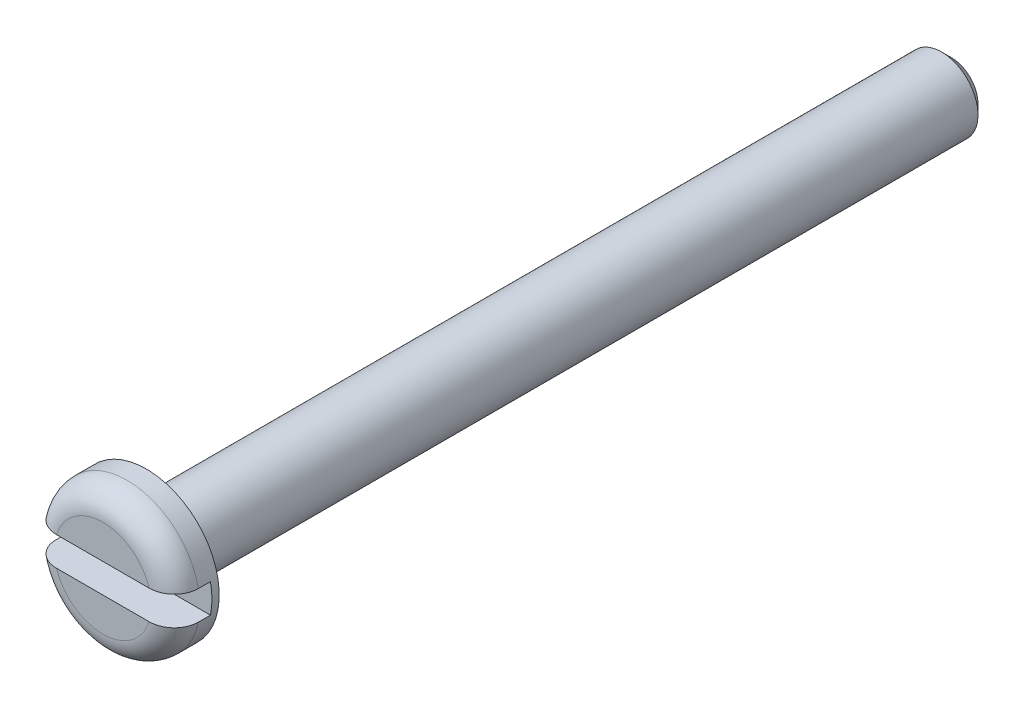
ISO-10303-21;
HEADER;
FILE_DESCRIPTION(('STEP AP214'),'2;1');
FILE_NAME('part.step','',(''),(''),'','','');
FILE_SCHEMA(('AUTOMOTIVE_DESIGN { 1 0 10303 214 1 1 1 1 }'));
ENDSEC;
DATA;
#1=APPLICATION_CONTEXT('core data for automotive mechanical design processes');
#2=APPLICATION_PROTOCOL_DEFINITION('international standard','automotive_design',2000,#1);
#3=PRODUCT_CONTEXT('',#1,'mechanical');
#4=PRODUCT('Part','Part','',(#3));
#5=PRODUCT_RELATED_PRODUCT_CATEGORY('part','',(#4));
#6=PRODUCT_DEFINITION_FORMATION('','',#4);
#7=PRODUCT_DEFINITION_CONTEXT('part definition',#1,'design');
#8=PRODUCT_DEFINITION('design','',#6,#7);
#9=PRODUCT_DEFINITION_SHAPE('','',#8);
#10=(LENGTH_UNIT() NAMED_UNIT(*) SI_UNIT(.MILLI.,.METRE.));
#11=(NAMED_UNIT(*) PLANE_ANGLE_UNIT() SI_UNIT($,.RADIAN.));
#12=(NAMED_UNIT(*) SI_UNIT($,.STERADIAN.) SOLID_ANGLE_UNIT());
#13=UNCERTAINTY_MEASURE_WITH_UNIT(LENGTH_MEASURE(1.E-05),#10,'distance_accuracy_value','');
#14=(GEOMETRIC_REPRESENTATION_CONTEXT(3) GLOBAL_UNCERTAINTY_ASSIGNED_CONTEXT((#13)) GLOBAL_UNIT_ASSIGNED_CONTEXT((#10,
#11,#12)) REPRESENTATION_CONTEXT('',''));
#15=CARTESIAN_POINT('',(0.,0.,0.));
#16=DIRECTION('',(0.,0.,1.));
#17=DIRECTION('',(1.,0.,0.));
#18=AXIS2_PLACEMENT_3D('',#15,#16,#17);
#19=CARTESIAN_POINT('',(0.,0.,0.));
#20=DIRECTION('',(0.,0.,1.));
#21=DIRECTION('',(1.,0.,0.));
#22=AXIS2_PLACEMENT_3D('',#19,#20,#21);
#23=PLANE('',#22);
#24=DIRECTION('',(1.,0.,0.));
#25=VECTOR('',#24,1.);
#26=CARTESIAN_POINT('',(-3.,-0.6,0.));
#27=LINE('',#26,#25);
#28=CARTESIAN_POINT('',(-1.90787840283389,-0.6,0.));
#29=VERTEX_POINT('',#28);
#30=CARTESIAN_POINT('',(1.90787840283389,-0.6,0.));
#31=VERTEX_POINT('',#30);
#32=EDGE_CURVE('E124',#29,#31,#27,.T.);
#33=ORIENTED_EDGE('',*,*,#32,.F.);
#34=CARTESIAN_POINT('',(0.,0.,0.));
#35=DIRECTION('',(0.,0.,1.));
#36=DIRECTION('',(1.,0.,0.));
#37=AXIS2_PLACEMENT_3D('',#34,#35,#36);
#38=CIRCLE('',#37,2.);
#39=EDGE_CURVE('E140',#29,#31,#38,.T.);
#40=ORIENTED_EDGE('',*,*,#39,.T.);
#41=EDGE_LOOP('',(#33,#40));
#42=FACE_BOUND('',#41,.T.);
#43=ADVANCED_FACE('F34',(#42),#23,.T.);
#44=DIRECTION('',(1.,0.,0.));
#45=VECTOR('',#44,1.);
#46=CARTESIAN_POINT('',(-3.,0.6,0.));
#47=LINE('',#46,#45);
#48=CARTESIAN_POINT('',(-1.90787840283389,0.6,0.));
#49=VERTEX_POINT('',#48);
#50=CARTESIAN_POINT('',(1.90787840283389,0.6,0.));
#51=VERTEX_POINT('',#50);
#52=EDGE_CURVE('E106',#49,#51,#47,.T.);
#53=ORIENTED_EDGE('',*,*,#52,.T.);
#54=CARTESIAN_POINT('',(0.,0.,0.));
#55=DIRECTION('',(0.,0.,1.));
#56=DIRECTION('',(1.,0.,0.));
#57=AXIS2_PLACEMENT_3D('',#54,#55,#56);
#58=CIRCLE('',#57,2.);
#59=EDGE_CURVE('E55',#51,#49,#58,.T.);
#60=ORIENTED_EDGE('',*,*,#59,.T.);
#61=EDGE_LOOP('',(#53,#60));
#62=FACE_BOUND('',#61,.T.);
#63=ADVANCED_FACE('F188',(#62),#23,.T.);
#64=CARTESIAN_POINT('',(0.,0.,-35.));
#65=DIRECTION('',(0.,0.,-1.));
#66=DIRECTION('',(-1.,0.,0.));
#67=AXIS2_PLACEMENT_3D('',#64,#65,#66);
#68=CYLINDRICAL_SURFACE('',#67,3.);
#69=DIRECTION('',(0.,0.,-1.));
#70=VECTOR('',#69,1.);
#71=CARTESIAN_POINT('',(2.93938769133981,-0.6,-35.));
#72=LINE('',#71,#70);
#73=CARTESIAN_POINT('',(2.93938769133981,-0.6,-1.));
#74=VERTEX_POINT('',#73);
#75=CARTESIAN_POINT('',(2.93938769133981,-0.6,-1.5));
#76=VERTEX_POINT('',#75);
#77=EDGE_CURVE('E97',#74,#76,#72,.T.);
#78=ORIENTED_EDGE('',*,*,#77,.F.);
#79=CARTESIAN_POINT('',(0.,0.,-1.));
#80=DIRECTION('',(0.,0.,1.));
#81=DIRECTION('',(1.,0.,0.));
#82=AXIS2_PLACEMENT_3D('',#79,#80,#81);
#83=CIRCLE('',#82,3.);
#84=CARTESIAN_POINT('',(-2.93938769133981,-0.6,-1.));
#85=VERTEX_POINT('',#84);
#86=EDGE_CURVE('E141',#74,#85,#83,.F.);
#87=ORIENTED_EDGE('',*,*,#86,.T.);
#88=DIRECTION('',(0.,0.,-1.));
#89=VECTOR('',#88,1.);
#90=CARTESIAN_POINT('',(-2.93938769133982,-0.6,-35.));
#91=LINE('',#90,#89);
#92=CARTESIAN_POINT('',(-2.93938769133981,-0.6,-1.5));
#93=VERTEX_POINT('',#92);
#94=EDGE_CURVE('E114',#93,#85,#91,.F.);
#95=ORIENTED_EDGE('',*,*,#94,.F.);
#96=CARTESIAN_POINT('',(0.,0.,-1.5));
#97=DIRECTION('',(0.,0.,-1.));
#98=DIRECTION('',(-1.,0.,0.));
#99=AXIS2_PLACEMENT_3D('',#96,#97,#98);
#100=CIRCLE('',#99,3.);
#101=CARTESIAN_POINT('',(-2.93938769133981,0.6,-1.5));
#102=VERTEX_POINT('',#101);
#103=EDGE_CURVE('E98',#102,#93,#100,.F.);
#104=ORIENTED_EDGE('',*,*,#103,.F.);
#105=DIRECTION('',(0.,0.,-1.));
#106=VECTOR('',#105,1.);
#107=CARTESIAN_POINT('',(-2.93938769133982,0.6,-35.));
#108=LINE('',#107,#106);
#109=CARTESIAN_POINT('',(-2.93938769133981,0.6,-1.));
#110=VERTEX_POINT('',#109);
#111=EDGE_CURVE('E86',#110,#102,#108,.T.);
#112=ORIENTED_EDGE('',*,*,#111,.F.);
#113=CARTESIAN_POINT('',(0.,0.,-1.));
#114=DIRECTION('',(0.,0.,1.));
#115=DIRECTION('',(1.,0.,0.));
#116=AXIS2_PLACEMENT_3D('',#113,#114,#115);
#117=CIRCLE('',#116,3.);
#118=CARTESIAN_POINT('',(2.93938769133981,0.6,-1.));
#119=VERTEX_POINT('',#118);
#120=EDGE_CURVE('E144',#110,#119,#117,.F.);
#121=ORIENTED_EDGE('',*,*,#120,.T.);
#122=DIRECTION('',(0.,0.,-1.));
#123=VECTOR('',#122,1.);
#124=CARTESIAN_POINT('',(2.93938769133981,0.6,-35.));
#125=LINE('',#124,#123);
#126=CARTESIAN_POINT('',(2.93938769133981,0.6,-1.5));
#127=VERTEX_POINT('',#126);
#128=EDGE_CURVE('E115',#127,#119,#125,.F.);
#129=ORIENTED_EDGE('',*,*,#128,.F.);
#130=EDGE_CURVE('E105',#76,#127,#100,.F.);
#131=ORIENTED_EDGE('',*,*,#130,.F.);
#132=EDGE_LOOP('',(#78,#87,#95,#104,#112,#121,#129,#131));
#133=FACE_BOUND('',#132,.T.);
#134=CARTESIAN_POINT('',(0.,0.,-1.8));
#135=DIRECTION('',(0.,0.,-1.));
#136=DIRECTION('',(-1.,0.,0.));
#137=AXIS2_PLACEMENT_3D('',#134,#135,#136);
#138=CIRCLE('',#137,3.);
#139=CARTESIAN_POINT('',(-3.,0.,-1.8));
#140=VERTEX_POINT('',#139);
#141=EDGE_CURVE('E119',#140,#140,#138,.T.);
#142=ORIENTED_EDGE('',*,*,#141,.F.);
#143=EDGE_LOOP('',(#142));
#144=FACE_BOUND('',#143,.T.);
#145=ADVANCED_FACE('F110',(#133,#144),#68,.T.);
#146=CARTESIAN_POINT('',(-3.,0.,-1.8));
#147=DIRECTION('',(0.,0.,-1.));
#148=DIRECTION('',(-1.,0.,0.));
#149=AXIS2_PLACEMENT_3D('',#146,#147,#148);
#150=PLANE('',#149);
#151=CARTESIAN_POINT('',(0.,0.,-1.8));
#152=DIRECTION('',(0.,0.,-1.));
#153=DIRECTION('',(-1.,0.,0.));
#154=AXIS2_PLACEMENT_3D('',#151,#152,#153);
#155=CIRCLE('',#154,1.9);
#156=CARTESIAN_POINT('',(-1.9,0.,-1.8));
#157=VERTEX_POINT('',#156);
#158=EDGE_CURVE('E11',#157,#157,#155,.F.);
#159=ORIENTED_EDGE('',*,*,#158,.T.);
#160=EDGE_LOOP('',(#159));
#161=FACE_BOUND('',#160,.T.);
#162=ORIENTED_EDGE('',*,*,#141,.T.);
#163=EDGE_LOOP('',(#162));
#164=FACE_BOUND('',#163,.T.);
#165=ADVANCED_FACE('F219',(#161,#164),#150,.T.);
#166=CARTESIAN_POINT('',(0.,0.,-35.));
#167=DIRECTION('',(0.,0.,-1.));
#168=DIRECTION('',(-1.,0.,0.));
#169=AXIS2_PLACEMENT_3D('',#166,#167,#168);
#170=CYLINDRICAL_SURFACE('',#169,1.5);
#171=CARTESIAN_POINT('',(0.,0.,-2.2));
#172=DIRECTION('',(0.,0.,-1.));
#173=DIRECTION('',(-1.,0.,0.));
#174=AXIS2_PLACEMENT_3D('',#171,#172,#173);
#175=CIRCLE('',#174,1.5);
#176=CARTESIAN_POINT('',(-1.5,0.,-2.2));
#177=VERTEX_POINT('',#176);
#178=EDGE_CURVE('E42',#177,#177,#175,.T.);
#179=ORIENTED_EDGE('',*,*,#178,.T.);
#180=EDGE_LOOP('',(#179));
#181=FACE_BOUND('',#180,.T.);
#182=CARTESIAN_POINT('',(0.,0.,-34.6));
#183=DIRECTION('',(0.,0.,-1.));
#184=DIRECTION('',(-1.,0.,0.));
#185=AXIS2_PLACEMENT_3D('',#182,#183,#184);
#186=CIRCLE('',#185,1.5);
#187=CARTESIAN_POINT('',(-1.5,0.,-34.6));
#188=VERTEX_POINT('',#187);
#189=EDGE_CURVE('E202',#188,#188,#186,.F.);
#190=ORIENTED_EDGE('',*,*,#189,.T.);
#191=EDGE_LOOP('',(#190));
#192=FACE_BOUND('',#191,.T.);
#193=ADVANCED_FACE('F214',(#181,#192),#170,.T.);
#194=CARTESIAN_POINT('',(-1.5,0.,-35.));
#195=DIRECTION('',(0.,0.,-1.));
#196=DIRECTION('',(-1.,0.,0.));
#197=AXIS2_PLACEMENT_3D('',#194,#195,#196);
#198=PLANE('',#197);
#199=CARTESIAN_POINT('',(0.,0.,-35.));
#200=DIRECTION('',(0.,0.,-1.));
#201=DIRECTION('',(-1.,0.,0.));
#202=AXIS2_PLACEMENT_3D('',#199,#200,#201);
#203=CIRCLE('',#202,1.1);
#204=CARTESIAN_POINT('',(-1.1,0.,-35.));
#205=VERTEX_POINT('',#204);
#206=EDGE_CURVE('E205',#205,#205,#203,.T.);
#207=ORIENTED_EDGE('',*,*,#206,.T.);
#208=EDGE_LOOP('',(#207));
#209=FACE_BOUND('',#208,.T.);
#210=ADVANCED_FACE('F218',(#209),#198,.T.);
#211=CARTESIAN_POINT('',(-3.,0.6,-1.5));
#212=DIRECTION('',(0.,0.,-1.));
#213=DIRECTION('',(-1.,0.,0.));
#214=AXIS2_PLACEMENT_3D('',#211,#212,#213);
#215=PLANE('',#214);
#216=DIRECTION('',(1.,0.,0.));
#217=VECTOR('',#216,1.);
#218=CARTESIAN_POINT('',(-3.,-0.6,-1.5));
#219=LINE('',#218,#217);
#220=EDGE_CURVE('E121',#93,#76,#219,.T.);
#221=ORIENTED_EDGE('',*,*,#220,.T.);
#222=ORIENTED_EDGE('',*,*,#130,.T.);
#223=DIRECTION('',(1.,0.,0.));
#224=VECTOR('',#223,1.);
#225=CARTESIAN_POINT('',(-3.,0.6,-1.5));
#226=LINE('',#225,#224);
#227=EDGE_CURVE('E89',#102,#127,#226,.T.);
#228=ORIENTED_EDGE('',*,*,#227,.F.);
#229=ORIENTED_EDGE('',*,*,#103,.T.);
#230=EDGE_LOOP('',(#221,#222,#228,#229));
#231=FACE_BOUND('',#230,.T.);
#232=ADVANCED_FACE('F102',(#231),#215,.F.);
#233=CARTESIAN_POINT('',(-3.,-0.6,0.));
#234=DIRECTION('',(0.,-1.,0.));
#235=DIRECTION('',(0.,0.,-1.));
#236=AXIS2_PLACEMENT_3D('',#233,#234,#235);
#237=PLANE('',#236);
#238=ORIENTED_EDGE('',*,*,#94,.T.);
#239=CARTESIAN_POINT('',(-2.93938769133981,-0.6,-1.));
#240=CARTESIAN_POINT('',(-2.93938770276771,-0.6,-0.972321638172543));
#241=CARTESIAN_POINT('',(-2.93821410236521,-0.6,-0.944656636253291));
#242=CARTESIAN_POINT('',(-2.93353349431521,-0.6,-0.889526861951234));
#243=CARTESIAN_POINT('',(-2.93002666366249,-0.6,-0.862062074540261));
#244=CARTESIAN_POINT('',(-2.91604632548902,-0.6,-0.780336207939879));
#245=CARTESIAN_POINT('',(-2.90211283648053,-0.6,-0.726626269474018));
#246=CARTESIAN_POINT('',(-2.86543751133069,-0.6,-0.622315882638988));
#247=CARTESIAN_POINT('',(-2.84269266515645,-0.6,-0.571716503714319));
#248=CARTESIAN_POINT('',(-2.78908511252595,-0.6,-0.475017339731336));
#249=CARTESIAN_POINT('',(-2.75822276982181,-0.6,-0.428917353178188));
#250=CARTESIAN_POINT('',(-2.68907078438919,-0.6,-0.342172235650511));
#251=CARTESIAN_POINT('',(-2.65073286093572,-0.6,-0.301565637861829));
#252=CARTESIAN_POINT('',(-2.56789366745151,-0.6,-0.227220078447088));
#253=CARTESIAN_POINT('',(-2.52339168993973,-0.6,-0.193481906245863));
#254=CARTESIAN_POINT('',(-2.42861084794114,-0.6,-0.133118586778812));
#255=CARTESIAN_POINT('',(-2.37823822200287,-0.6,-0.106640901724304));
#256=CARTESIAN_POINT('',(-2.27384844267111,-0.6,-0.0622394746542688));
#257=CARTESIAN_POINT('',(-2.21983105484844,-0.6,-0.0443162834590483));
#258=CARTESIAN_POINT('',(-2.12272739795855,-0.6,-0.02052714338367));
#259=CARTESIAN_POINT('',(-2.08008208035747,-0.6,-0.0128109577036062));
#260=CARTESIAN_POINT('',(-1.99425117998488,-0.6,-0.00254656462218898));
#261=CARTESIAN_POINT('',(-1.95106672026031,-0.6,1.10118978048816E-05));
#262=CARTESIAN_POINT('',(-1.90787840283389,-0.6,0.));
#263=B_SPLINE_CURVE_WITH_KNOTS('',3,(#239,#240,#241,#242,#243,#244,#245,#246,#247,#248,#249,
#250,#251,#252,#253,#254,#255,#256,#257,#258,#259,#260,#261,#262),.UNSPECIFIED.,.F.,.F.,(4,2,2,
2,2,2,2,2,2,2,2,4),(0.,0.0829837302474587,0.165961166211744,0.331568485715387,0.497232428013334,
0.662888948029177,0.829653081163284,0.996436370582135,1.16639122945738,1.33635703017953,
1.46606963518821,1.59554644193424),.UNSPECIFIED.);
#264=EDGE_CURVE('E134',#85,#29,#263,.T.);
#265=ORIENTED_EDGE('',*,*,#264,.T.);
#266=ORIENTED_EDGE('',*,*,#32,.T.);
#267=CARTESIAN_POINT('',(1.90787840283389,-0.6,0.));
#268=CARTESIAN_POINT('',(1.93773529066291,-0.6,-2.47548866331322E-07));
#269=CARTESIAN_POINT('',(1.96758017570234,-0.6,-0.00121770334634671));
#270=CARTESIAN_POINT('',(2.02707319186661,-0.6,-0.00610610499452562));
#271=CARTESIAN_POINT('',(2.05672128723217,-0.6,-0.009777485060849));
#272=CARTESIAN_POINT('',(2.14508838456847,-0.6,-0.0244993421219322));
#273=CARTESIAN_POINT('',(2.20323726850145,-0.6,-0.0392575272754314));
#274=CARTESIAN_POINT('',(2.3162480976835,-0.6,-0.0784798945949695));
#275=CARTESIAN_POINT('',(2.37110469865989,-0.6,-0.102959391387223));
#276=CARTESIAN_POINT('',(2.47571188316476,-0.6,-0.161057784489942));
#277=CARTESIAN_POINT('',(2.52546640218046,-0.6,-0.194669562459341));
#278=CARTESIAN_POINT('',(2.61684428964092,-0.6,-0.268970846938747));
#279=CARTESIAN_POINT('',(2.65867082350486,-0.6,-0.309410609137931));
#280=CARTESIAN_POINT('',(2.73471620678002,-0.6,-0.396932843703631));
#281=CARTESIAN_POINT('',(2.76893342699587,-0.6,-0.444016735093837));
#282=CARTESIAN_POINT('',(2.82779584490307,-0.6,-0.542047078322588));
#283=CARTESIAN_POINT('',(2.85267997210062,-0.6,-0.592850377348578));
#284=CARTESIAN_POINT('',(2.89338734810243,-0.6,-0.69794169710247));
#285=CARTESIAN_POINT('',(2.9092191570073,-0.6,-0.752226371536844));
#286=CARTESIAN_POINT('',(2.92663542181648,-0.6,-0.839129838729081));
#287=CARTESIAN_POINT('',(2.93141571310145,-0.6,-0.871141118720766));
#288=CARTESIAN_POINT('',(2.9377903551294,-0.6,-0.935429884254392));
#289=CARTESIAN_POINT('',(2.93938956207185,-0.6,-0.967706888381689));
#290=CARTESIAN_POINT('',(2.93938769133981,-0.6,-1.));
#291=B_SPLINE_CURVE_WITH_KNOTS('',3,(#267,#268,#269,#270,#271,#272,#273,#274,#275,#276,#277,
#278,#279,#280,#281,#282,#283,#284,#285,#286,#287,#288,#289,#290),.UNSPECIFIED.,.F.,.F.,(4,2,2,
2,2,2,2,2,2,2,2,4),(0.,0.089520567636369,0.17905697990329,0.358108854014581,0.537443926548799,
0.716639611790978,0.890318718479495,1.06403497508267,1.23293840849202,1.40168185727531,
1.49863809906623,1.59544621485453),.UNSPECIFIED.);
#292=EDGE_CURVE('E133',#31,#74,#291,.T.);
#293=ORIENTED_EDGE('',*,*,#292,.T.);
#294=ORIENTED_EDGE('',*,*,#77,.T.);
#295=ORIENTED_EDGE('',*,*,#220,.F.);
#296=EDGE_LOOP('',(#238,#265,#266,#293,#294,#295));
#297=FACE_BOUND('',#296,.T.);
#298=ADVANCED_FACE('F132',(#297),#237,.F.);
#299=CARTESIAN_POINT('',(-3.,0.6,0.));
#300=DIRECTION('',(0.,1.,0.));
#301=DIRECTION('',(0.,0.,1.));
#302=AXIS2_PLACEMENT_3D('',#299,#300,#301);
#303=PLANE('',#302);
#304=ORIENTED_EDGE('',*,*,#128,.T.);
#305=CARTESIAN_POINT('',(2.93938769133981,0.6,-1.));
#306=CARTESIAN_POINT('',(2.93938770276771,0.6,-0.972321638172543));
#307=CARTESIAN_POINT('',(2.93821410236521,0.6,-0.944656636253291));
#308=CARTESIAN_POINT('',(2.93353349431521,0.6,-0.889526861951235));
#309=CARTESIAN_POINT('',(2.93002666366249,0.6,-0.862062074540261));
#310=CARTESIAN_POINT('',(2.91604632548902,0.6,-0.78033620793988));
#311=CARTESIAN_POINT('',(2.90211283648053,0.6,-0.726626269474018));
#312=CARTESIAN_POINT('',(2.86543751133069,0.6,-0.622315882638988));
#313=CARTESIAN_POINT('',(2.84269266515645,0.6,-0.57171650371432));
#314=CARTESIAN_POINT('',(2.78908511252595,0.6,-0.475017339731337));
#315=CARTESIAN_POINT('',(2.75822276982181,0.6,-0.428917353178188));
#316=CARTESIAN_POINT('',(2.68907078438919,0.6,-0.342172235650512));
#317=CARTESIAN_POINT('',(2.65073286093572,0.6,-0.30156563786183));
#318=CARTESIAN_POINT('',(2.56789366745151,0.6,-0.227220078447088));
#319=CARTESIAN_POINT('',(2.52339168993973,0.6,-0.193481906245864));
#320=CARTESIAN_POINT('',(2.42861084794114,0.6,-0.133118586778813));
#321=CARTESIAN_POINT('',(2.37823822200287,0.6,-0.106640901724304));
#322=CARTESIAN_POINT('',(2.27384844267111,0.6,-0.0622394746542692));
#323=CARTESIAN_POINT('',(2.21983105484844,0.6,-0.0443162834590487));
#324=CARTESIAN_POINT('',(2.12272739795855,0.6,-0.0205271433836705));
#325=CARTESIAN_POINT('',(2.08008208035747,0.6,-0.0128109577036068));
#326=CARTESIAN_POINT('',(1.99425117998488,0.6,-0.00254656462218969));
#327=CARTESIAN_POINT('',(1.95106672026031,0.6,1.10118978042003E-05));
#328=CARTESIAN_POINT('',(1.90787840283389,0.6,0.));
#329=B_SPLINE_CURVE_WITH_KNOTS('',3,(#305,#306,#307,#308,#309,#310,#311,#312,#313,#314,#315,
#316,#317,#318,#319,#320,#321,#322,#323,#324,#325,#326,#327,#328),.UNSPECIFIED.,.F.,.F.,(4,2,2,
2,2,2,2,2,2,2,2,4),(0.,0.0829837302474586,0.165961166211745,0.331568485715387,0.497232428013334,
0.662888948029178,0.829653081163284,0.996436370582135,1.16639122945738,1.33635703017953,
1.46606963518821,1.59554644193424),.UNSPECIFIED.);
#330=EDGE_CURVE('E49',#119,#51,#329,.T.);
#331=ORIENTED_EDGE('',*,*,#330,.T.);
#332=ORIENTED_EDGE('',*,*,#52,.F.);
#333=CARTESIAN_POINT('',(-1.90787840283389,0.6,0.));
#334=CARTESIAN_POINT('',(-1.93773529066291,0.6,-2.47548865933866E-07));
#335=CARTESIAN_POINT('',(-1.96758017570234,0.6,-0.00121770334634627));
#336=CARTESIAN_POINT('',(-2.02707319186661,0.6,-0.00610610499452514));
#337=CARTESIAN_POINT('',(-2.05672128723217,0.6,-0.00977748506084853));
#338=CARTESIAN_POINT('',(-2.14508838456847,0.6,-0.0244993421219318));
#339=CARTESIAN_POINT('',(-2.20323726850145,0.6,-0.0392575272754311));
#340=CARTESIAN_POINT('',(-2.3162480976835,0.6,-0.0784798945949692));
#341=CARTESIAN_POINT('',(-2.37110469865989,0.6,-0.102959391387223));
#342=CARTESIAN_POINT('',(-2.47571188316476,0.6,-0.161057784489941));
#343=CARTESIAN_POINT('',(-2.52546640218046,0.6,-0.194669562459341));
#344=CARTESIAN_POINT('',(-2.61684428964092,0.6,-0.268970846938746));
#345=CARTESIAN_POINT('',(-2.65867082350486,0.6,-0.30941060913793));
#346=CARTESIAN_POINT('',(-2.73471620678002,0.6,-0.39693284370363));
#347=CARTESIAN_POINT('',(-2.76893342699587,0.6,-0.444016735093837));
#348=CARTESIAN_POINT('',(-2.82779584490307,0.6,-0.542047078322588));
#349=CARTESIAN_POINT('',(-2.85267997210062,0.6,-0.592850377348577));
#350=CARTESIAN_POINT('',(-2.89338734810243,0.6,-0.697941697102469));
#351=CARTESIAN_POINT('',(-2.9092191570073,0.6,-0.752226371536844));
#352=CARTESIAN_POINT('',(-2.92663542181648,0.6,-0.839129838729081));
#353=CARTESIAN_POINT('',(-2.93141571310145,0.6,-0.871141118720766));
#354=CARTESIAN_POINT('',(-2.9377903551294,0.6,-0.935429884254392));
#355=CARTESIAN_POINT('',(-2.93938956207185,0.6,-0.967706888381688));
#356=CARTESIAN_POINT('',(-2.93938769133981,0.6,-1.));
#357=B_SPLINE_CURVE_WITH_KNOTS('',3,(#333,#334,#335,#336,#337,#338,#339,#340,#341,#342,#343,
#344,#345,#346,#347,#348,#349,#350,#351,#352,#353,#354,#355,#356),.UNSPECIFIED.,.F.,.F.,(4,2,2,
2,2,2,2,2,2,2,2,4),(0.,0.089520567636369,0.17905697990329,0.358108854014581,0.537443926548799,
0.716639611790978,0.890318718479495,1.06403497508267,1.23293840849202,1.40168185727531,
1.49863809906623,1.59544621485453),.UNSPECIFIED.);
#358=EDGE_CURVE('E92',#49,#110,#357,.T.);
#359=ORIENTED_EDGE('',*,*,#358,.T.);
#360=ORIENTED_EDGE('',*,*,#111,.T.);
#361=ORIENTED_EDGE('',*,*,#227,.T.);
#362=EDGE_LOOP('',(#304,#331,#332,#359,#360,#361));
#363=FACE_BOUND('',#362,.T.);
#364=ADVANCED_FACE('F88',(#363),#303,.F.);
#365=CARTESIAN_POINT('',(0.,0.,-35.));
#366=DIRECTION('',(0.,0.,1.));
#367=DIRECTION('',(1.,0.,0.));
#368=AXIS2_PLACEMENT_3D('',#365,#366,#367);
#369=CONICAL_SURFACE('',#368,1.1,0.785398163397447);
#370=ORIENTED_EDGE('',*,*,#189,.F.);
#371=EDGE_LOOP('',(#370));
#372=FACE_BOUND('',#371,.T.);
#373=ORIENTED_EDGE('',*,*,#206,.F.);
#374=EDGE_LOOP('',(#373));
#375=FACE_BOUND('',#374,.T.);
#376=ADVANCED_FACE('F165',(#372,#375),#369,.T.);
#377=CARTESIAN_POINT('',(0.,0.,-1.));
#378=DIRECTION('',(0.,0.,1.));
#379=DIRECTION('',(1.,0.,0.));
#380=AXIS2_PLACEMENT_3D('',#377,#378,#379);
#381=TOROIDAL_SURFACE('',#380,2.,1.);
#382=ORIENTED_EDGE('',*,*,#292,.F.);
#383=ORIENTED_EDGE('',*,*,#39,.F.);
#384=ORIENTED_EDGE('',*,*,#264,.F.);
#385=ORIENTED_EDGE('',*,*,#86,.F.);
#386=EDGE_LOOP('',(#382,#383,#384,#385));
#387=FACE_BOUND('',#386,.T.);
#388=ADVANCED_FACE('F139',(#387),#381,.T.);
#389=CARTESIAN_POINT('',(0.,0.,-1.));
#390=DIRECTION('',(0.,0.,1.));
#391=DIRECTION('',(1.,0.,0.));
#392=AXIS2_PLACEMENT_3D('',#389,#390,#391);
#393=TOROIDAL_SURFACE('',#392,2.,1.);
#394=ORIENTED_EDGE('',*,*,#358,.F.);
#395=ORIENTED_EDGE('',*,*,#59,.F.);
#396=ORIENTED_EDGE('',*,*,#330,.F.);
#397=ORIENTED_EDGE('',*,*,#120,.F.);
#398=EDGE_LOOP('',(#394,#395,#396,#397));
#399=FACE_BOUND('',#398,.T.);
#400=ADVANCED_FACE('F177',(#399),#393,.T.);
#401=CARTESIAN_POINT('',(0.,0.,-2.2));
#402=DIRECTION('',(0.,0.,-1.));
#403=DIRECTION('',(-1.,0.,0.));
#404=AXIS2_PLACEMENT_3D('',#401,#402,#403);
#405=TOROIDAL_SURFACE('',#404,1.9,0.4);
#406=ORIENTED_EDGE('',*,*,#158,.F.);
#407=EDGE_LOOP('',(#406));
#408=FACE_BOUND('',#407,.T.);
#409=ORIENTED_EDGE('',*,*,#178,.F.);
#410=EDGE_LOOP('',(#409));
#411=FACE_BOUND('',#410,.T.);
#412=ADVANCED_FACE('F36',(#408,#411),#405,.F.);
#413=CLOSED_SHELL('',(#43,#63,#145,#165,#193,#210,#232,#298,#364,#376,#388,#400,#412));
#414=MANIFOLD_SOLID_BREP('B2',#413);
#415=ADVANCED_BREP_SHAPE_REPRESENTATION('',(#18,#414),#14);
#416=SHAPE_DEFINITION_REPRESENTATION(#9,#415);
ENDSEC;
END-ISO-10303-21;
